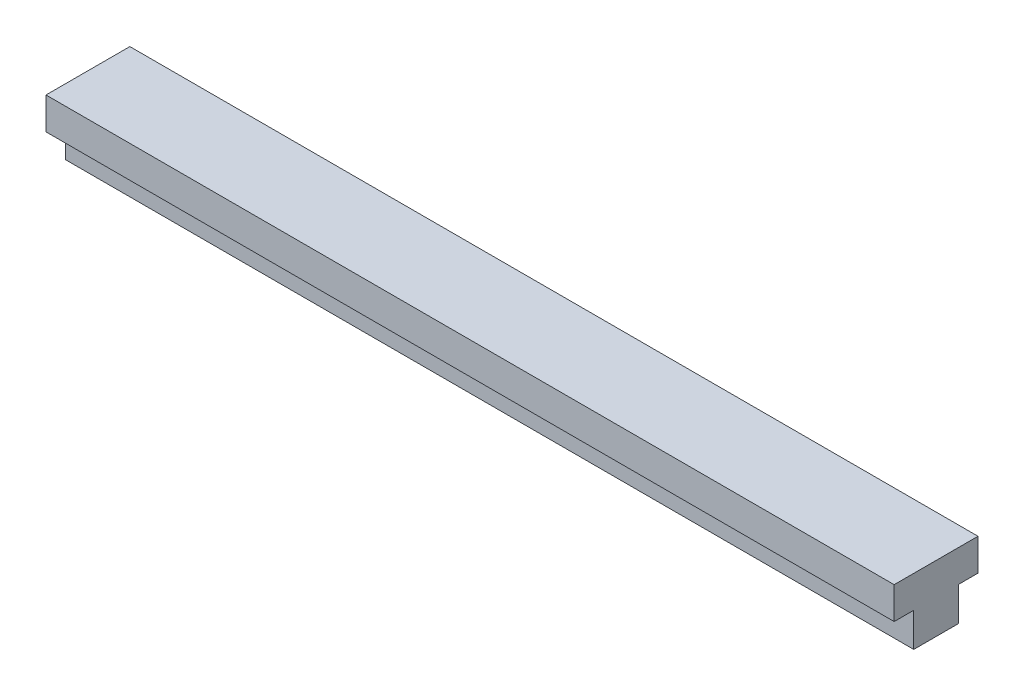
ISO-10303-21;
HEADER;
FILE_DESCRIPTION(('STEP AP214'),'2;1');
FILE_NAME('part.step','',(''),(''),'','','');
FILE_SCHEMA(('AUTOMOTIVE_DESIGN { 1 0 10303 214 1 1 1 1 }'));
ENDSEC;
DATA;
#1=APPLICATION_CONTEXT('core data for automotive mechanical design processes');
#2=APPLICATION_PROTOCOL_DEFINITION('international standard','automotive_design',2000,#1);
#3=PRODUCT_CONTEXT('',#1,'mechanical');
#4=PRODUCT('Part','Part','',(#3));
#5=PRODUCT_RELATED_PRODUCT_CATEGORY('part','',(#4));
#6=PRODUCT_DEFINITION_FORMATION('','',#4);
#7=PRODUCT_DEFINITION_CONTEXT('part definition',#1,'design');
#8=PRODUCT_DEFINITION('design','',#6,#7);
#9=PRODUCT_DEFINITION_SHAPE('','',#8);
#10=(LENGTH_UNIT() NAMED_UNIT(*) SI_UNIT(.MILLI.,.METRE.));
#11=(NAMED_UNIT(*) PLANE_ANGLE_UNIT() SI_UNIT($,.RADIAN.));
#12=(NAMED_UNIT(*) SI_UNIT($,.STERADIAN.) SOLID_ANGLE_UNIT());
#13=UNCERTAINTY_MEASURE_WITH_UNIT(LENGTH_MEASURE(1.E-05),#10,'distance_accuracy_value','');
#14=(GEOMETRIC_REPRESENTATION_CONTEXT(3) GLOBAL_UNCERTAINTY_ASSIGNED_CONTEXT((#13)) GLOBAL_UNIT_ASSIGNED_CONTEXT((#10,
#11,#12)) REPRESENTATION_CONTEXT('',''));
#15=CARTESIAN_POINT('',(0.,0.,0.));
#16=DIRECTION('',(0.,0.,1.));
#17=DIRECTION('',(1.,0.,0.));
#18=AXIS2_PLACEMENT_3D('',#15,#16,#17);
#19=CARTESIAN_POINT('',(-95.,-76.,26.0999));
#20=DIRECTION('',(0.,1.,0.));
#21=DIRECTION('',(-1.,0.,0.));
#22=AXIS2_PLACEMENT_3D('',#19,#20,#21);
#23=PLANE('',#22);
#24=DIRECTION('',(-1.,0.,0.));
#25=VECTOR('',#24,1.);
#26=CARTESIAN_POINT('',(35.,-76.,14.05));
#27=LINE('',#26,#25);
#28=CARTESIAN_POINT('',(35.,-76.,14.05));
#29=VERTEX_POINT('',#28);
#30=CARTESIAN_POINT('',(-95.,-76.,14.05));
#31=VERTEX_POINT('',#30);
#32=EDGE_CURVE('E11',#29,#31,#27,.T.);
#33=ORIENTED_EDGE('',*,*,#32,.T.);
#34=DIRECTION('',(0.,0.,1.));
#35=VECTOR('',#34,1.);
#36=CARTESIAN_POINT('',(-95.,-76.,10.));
#37=LINE('',#36,#35);
#38=CARTESIAN_POINT('',(-95.,-76.,7.2));
#39=VERTEX_POINT('',#38);
#40=EDGE_CURVE('E56',#39,#31,#37,.T.);
#41=ORIENTED_EDGE('',*,*,#40,.F.);
#42=DIRECTION('',(-1.,0.,0.));
#43=VECTOR('',#42,1.);
#44=CARTESIAN_POINT('',(35.,-76.,7.2));
#45=LINE('',#44,#43);
#46=CARTESIAN_POINT('',(35.,-76.,7.2));
#47=VERTEX_POINT('',#46);
#48=EDGE_CURVE('E148',#47,#39,#45,.T.);
#49=ORIENTED_EDGE('',*,*,#48,.F.);
#50=DIRECTION('',(0.,0.,-1.));
#51=VECTOR('',#50,1.);
#52=CARTESIAN_POINT('',(35.,-76.,0.));
#53=LINE('',#52,#51);
#54=EDGE_CURVE('E43',#29,#47,#53,.T.);
#55=ORIENTED_EDGE('',*,*,#54,.F.);
#56=EDGE_LOOP('',(#33,#41,#49,#55));
#57=FACE_BOUND('',#56,.T.);
#58=ADVANCED_FACE('F35',(#57),#23,.F.);
#59=CARTESIAN_POINT('',(35.,0.,4.2));
#60=DIRECTION('',(0.,0.,-1.));
#61=DIRECTION('',(-1.,0.,0.));
#62=AXIS2_PLACEMENT_3D('',#59,#60,#61);
#63=PLANE('',#62);
#64=DIRECTION('',(0.,-1.,0.));
#65=VECTOR('',#64,1.);
#66=CARTESIAN_POINT('',(-95.,0.,4.2));
#67=LINE('',#66,#65);
#68=CARTESIAN_POINT('',(-95.,-65.9,4.2));
#69=VERTEX_POINT('',#68);
#70=CARTESIAN_POINT('',(-95.,-70.8,4.2));
#71=VERTEX_POINT('',#70);
#72=EDGE_CURVE('E105',#69,#71,#67,.T.);
#73=ORIENTED_EDGE('',*,*,#72,.F.);
#74=DIRECTION('',(-1.,0.,0.));
#75=VECTOR('',#74,1.);
#76=CARTESIAN_POINT('',(35.,-65.9,4.2));
#77=LINE('',#76,#75);
#78=CARTESIAN_POINT('',(35.,-65.9,4.2));
#79=VERTEX_POINT('',#78);
#80=EDGE_CURVE('E100',#79,#69,#77,.T.);
#81=ORIENTED_EDGE('',*,*,#80,.F.);
#82=DIRECTION('',(0.,-1.,0.));
#83=VECTOR('',#82,1.);
#84=CARTESIAN_POINT('',(35.,0.,4.2));
#85=LINE('',#84,#83);
#86=CARTESIAN_POINT('',(35.,-70.8,4.2));
#87=VERTEX_POINT('',#86);
#88=EDGE_CURVE('E103',#79,#87,#85,.T.);
#89=ORIENTED_EDGE('',*,*,#88,.T.);
#90=DIRECTION('',(-1.,0.,0.));
#91=VECTOR('',#90,1.);
#92=CARTESIAN_POINT('',(35.,-70.8,4.2));
#93=LINE('',#92,#91);
#94=EDGE_CURVE('E110',#87,#71,#93,.T.);
#95=ORIENTED_EDGE('',*,*,#94,.T.);
#96=EDGE_LOOP('',(#73,#81,#89,#95));
#97=FACE_BOUND('',#96,.T.);
#98=ADVANCED_FACE('F102',(#97),#63,.T.);
#99=CARTESIAN_POINT('',(35.,-65.9,0.));
#100=DIRECTION('',(0.,1.,0.));
#101=DIRECTION('',(0.,0.,1.));
#102=AXIS2_PLACEMENT_3D('',#99,#100,#101);
#103=PLANE('',#102);
#104=DIRECTION('',(0.,0.,-1.));
#105=VECTOR('',#104,1.);
#106=CARTESIAN_POINT('',(-95.,-65.9,0.));
#107=LINE('',#106,#105);
#108=CARTESIAN_POINT('',(-95.,-65.9,17.05));
#109=VERTEX_POINT('',#108);
#110=EDGE_CURVE('E135',#109,#69,#107,.T.);
#111=ORIENTED_EDGE('',*,*,#110,.F.);
#112=DIRECTION('',(-1.,0.,0.));
#113=VECTOR('',#112,1.);
#114=CARTESIAN_POINT('',(35.,-65.9,17.05));
#115=LINE('',#114,#113);
#116=CARTESIAN_POINT('',(35.,-65.9,17.05));
#117=VERTEX_POINT('',#116);
#118=EDGE_CURVE('E124',#117,#109,#115,.T.);
#119=ORIENTED_EDGE('',*,*,#118,.F.);
#120=DIRECTION('',(0.,0.,-1.));
#121=VECTOR('',#120,1.);
#122=CARTESIAN_POINT('',(35.,-65.9,0.));
#123=LINE('',#122,#121);
#124=EDGE_CURVE('E117',#117,#79,#123,.T.);
#125=ORIENTED_EDGE('',*,*,#124,.T.);
#126=ORIENTED_EDGE('',*,*,#80,.T.);
#127=EDGE_LOOP('',(#111,#119,#125,#126));
#128=FACE_BOUND('',#127,.T.);
#129=ADVANCED_FACE('F123',(#128),#103,.T.);
#130=CARTESIAN_POINT('',(35.,0.,17.05));
#131=DIRECTION('',(0.,0.,-1.));
#132=DIRECTION('',(-1.,0.,0.));
#133=AXIS2_PLACEMENT_3D('',#130,#131,#132);
#134=PLANE('',#133);
#135=DIRECTION('',(0.,-1.,0.));
#136=VECTOR('',#135,1.);
#137=CARTESIAN_POINT('',(-95.,0.,17.05));
#138=LINE('',#137,#136);
#139=CARTESIAN_POINT('',(-95.,-70.8,17.05));
#140=VERTEX_POINT('',#139);
#141=EDGE_CURVE('E126',#109,#140,#138,.T.);
#142=ORIENTED_EDGE('',*,*,#141,.T.);
#143=DIRECTION('',(-1.,0.,0.));
#144=VECTOR('',#143,1.);
#145=CARTESIAN_POINT('',(35.,-70.8,17.05));
#146=LINE('',#145,#144);
#147=CARTESIAN_POINT('',(35.,-70.8,17.05));
#148=VERTEX_POINT('',#147);
#149=EDGE_CURVE('E143',#148,#140,#146,.T.);
#150=ORIENTED_EDGE('',*,*,#149,.F.);
#151=DIRECTION('',(0.,-1.,0.));
#152=VECTOR('',#151,1.);
#153=CARTESIAN_POINT('',(35.,0.,17.05));
#154=LINE('',#153,#152);
#155=EDGE_CURVE('E111',#117,#148,#154,.T.);
#156=ORIENTED_EDGE('',*,*,#155,.F.);
#157=ORIENTED_EDGE('',*,*,#118,.T.);
#158=EDGE_LOOP('',(#142,#150,#156,#157));
#159=FACE_BOUND('',#158,.T.);
#160=ADVANCED_FACE('F195',(#159),#134,.F.);
#161=CARTESIAN_POINT('',(35.,-70.8,0.));
#162=DIRECTION('',(0.,1.,0.));
#163=DIRECTION('',(0.,0.,1.));
#164=AXIS2_PLACEMENT_3D('',#161,#162,#163);
#165=PLANE('',#164);
#166=DIRECTION('',(0.,0.,-1.));
#167=VECTOR('',#166,1.);
#168=CARTESIAN_POINT('',(-95.,-70.8,0.));
#169=LINE('',#168,#167);
#170=CARTESIAN_POINT('',(-95.,-70.8,14.05));
#171=VERTEX_POINT('',#170);
#172=EDGE_CURVE('E128',#140,#171,#169,.T.);
#173=ORIENTED_EDGE('',*,*,#172,.T.);
#174=DIRECTION('',(-1.,0.,0.));
#175=VECTOR('',#174,1.);
#176=CARTESIAN_POINT('',(35.,-70.8,14.05));
#177=LINE('',#176,#175);
#178=CARTESIAN_POINT('',(35.,-70.8,14.05));
#179=VERTEX_POINT('',#178);
#180=EDGE_CURVE('E146',#179,#171,#177,.T.);
#181=ORIENTED_EDGE('',*,*,#180,.F.);
#182=DIRECTION('',(0.,0.,-1.));
#183=VECTOR('',#182,1.);
#184=CARTESIAN_POINT('',(35.,-70.8,0.));
#185=LINE('',#184,#183);
#186=EDGE_CURVE('E133',#148,#179,#185,.T.);
#187=ORIENTED_EDGE('',*,*,#186,.F.);
#188=ORIENTED_EDGE('',*,*,#149,.T.);
#189=EDGE_LOOP('',(#173,#181,#187,#188));
#190=FACE_BOUND('',#189,.T.);
#191=ADVANCED_FACE('F188',(#190),#165,.F.);
#192=CARTESIAN_POINT('',(35.,-150.,0.));
#193=DIRECTION('',(-1.,0.,0.));
#194=DIRECTION('',(0.,0.,1.));
#195=AXIS2_PLACEMENT_3D('',#192,#193,#194);
#196=PLANE('',#195);
#197=DIRECTION('',(0.,-1.,0.));
#198=VECTOR('',#197,1.);
#199=CARTESIAN_POINT('',(35.,0.,14.05));
#200=LINE('',#199,#198);
#201=EDGE_CURVE('E162',#179,#29,#200,.T.);
#202=ORIENTED_EDGE('',*,*,#201,.T.);
#203=ORIENTED_EDGE('',*,*,#54,.T.);
#204=DIRECTION('',(0.,-1.,0.));
#205=VECTOR('',#204,1.);
#206=CARTESIAN_POINT('',(35.,0.,7.19999999999996));
#207=LINE('',#206,#205);
#208=CARTESIAN_POINT('',(35.,-70.8,7.2));
#209=VERTEX_POINT('',#208);
#210=EDGE_CURVE('E132',#209,#47,#207,.T.);
#211=ORIENTED_EDGE('',*,*,#210,.F.);
#212=EDGE_CURVE('E120',#209,#87,#185,.T.);
#213=ORIENTED_EDGE('',*,*,#212,.T.);
#214=ORIENTED_EDGE('',*,*,#88,.F.);
#215=ORIENTED_EDGE('',*,*,#124,.F.);
#216=ORIENTED_EDGE('',*,*,#155,.T.);
#217=ORIENTED_EDGE('',*,*,#186,.T.);
#218=EDGE_LOOP('',(#202,#203,#211,#213,#214,#215,#216,#217));
#219=FACE_BOUND('',#218,.T.);
#220=ADVANCED_FACE('F116',(#219),#196,.F.);
#221=CARTESIAN_POINT('',(-95.,-70.8,7.2));
#222=VERTEX_POINT('',#221);
#223=EDGE_CURVE('E138',#222,#71,#169,.T.);
#224=ORIENTED_EDGE('',*,*,#223,.T.);
#225=ORIENTED_EDGE('',*,*,#94,.F.);
#226=ORIENTED_EDGE('',*,*,#212,.F.);
#227=DIRECTION('',(-1.,0.,0.));
#228=VECTOR('',#227,1.);
#229=CARTESIAN_POINT('',(35.,-70.8,7.2));
#230=LINE('',#229,#228);
#231=EDGE_CURVE('E153',#209,#222,#230,.T.);
#232=ORIENTED_EDGE('',*,*,#231,.T.);
#233=EDGE_LOOP('',(#224,#225,#226,#232));
#234=FACE_BOUND('',#233,.T.);
#235=ADVANCED_FACE('F179',(#234),#165,.F.);
#236=CARTESIAN_POINT('',(-95.,-40.,10.));
#237=DIRECTION('',(1.,0.,0.));
#238=DIRECTION('',(0.,0.,-1.));
#239=AXIS2_PLACEMENT_3D('',#236,#237,#238);
#240=PLANE('',#239);
#241=DIRECTION('',(0.,-1.,0.));
#242=VECTOR('',#241,1.);
#243=CARTESIAN_POINT('',(-95.,0.,7.19999999999996));
#244=LINE('',#243,#242);
#245=EDGE_CURVE('E140',#222,#39,#244,.T.);
#246=ORIENTED_EDGE('',*,*,#245,.T.);
#247=ORIENTED_EDGE('',*,*,#40,.T.);
#248=DIRECTION('',(0.,-1.,0.));
#249=VECTOR('',#248,1.);
#250=CARTESIAN_POINT('',(-95.,0.,14.05));
#251=LINE('',#250,#249);
#252=EDGE_CURVE('E166',#171,#31,#251,.T.);
#253=ORIENTED_EDGE('',*,*,#252,.F.);
#254=ORIENTED_EDGE('',*,*,#172,.F.);
#255=ORIENTED_EDGE('',*,*,#141,.F.);
#256=ORIENTED_EDGE('',*,*,#110,.T.);
#257=ORIENTED_EDGE('',*,*,#72,.T.);
#258=ORIENTED_EDGE('',*,*,#223,.F.);
#259=EDGE_LOOP('',(#246,#247,#253,#254,#255,#256,#257,#258));
#260=FACE_BOUND('',#259,.T.);
#261=ADVANCED_FACE('F192',(#260),#240,.F.);
#262=CARTESIAN_POINT('',(35.,0.,7.19999999999996));
#263=DIRECTION('',(0.,0.,-1.));
#264=DIRECTION('',(0.,1.,0.));
#265=AXIS2_PLACEMENT_3D('',#262,#263,#264);
#266=PLANE('',#265);
#267=ORIENTED_EDGE('',*,*,#245,.F.);
#268=ORIENTED_EDGE('',*,*,#231,.F.);
#269=ORIENTED_EDGE('',*,*,#210,.T.);
#270=ORIENTED_EDGE('',*,*,#48,.T.);
#271=EDGE_LOOP('',(#267,#268,#269,#270));
#272=FACE_BOUND('',#271,.T.);
#273=ADVANCED_FACE('F176',(#272),#266,.T.);
#274=CARTESIAN_POINT('',(35.,0.,14.05));
#275=DIRECTION('',(0.,0.,-1.));
#276=DIRECTION('',(0.,1.,0.));
#277=AXIS2_PLACEMENT_3D('',#274,#275,#276);
#278=PLANE('',#277);
#279=ORIENTED_EDGE('',*,*,#252,.T.);
#280=ORIENTED_EDGE('',*,*,#32,.F.);
#281=ORIENTED_EDGE('',*,*,#201,.F.);
#282=ORIENTED_EDGE('',*,*,#180,.T.);
#283=EDGE_LOOP('',(#279,#280,#281,#282));
#284=FACE_BOUND('',#283,.T.);
#285=ADVANCED_FACE('F191',(#284),#278,.F.);
#286=CLOSED_SHELL('',(#58,#98,#129,#160,#191,#220,#235,#261,#273,#285));
#287=MANIFOLD_SOLID_BREP('B2',#286);
#288=ADVANCED_BREP_SHAPE_REPRESENTATION('',(#18,#287),#14);
#289=SHAPE_DEFINITION_REPRESENTATION(#9,#288);
ENDSEC;
END-ISO-10303-21;
